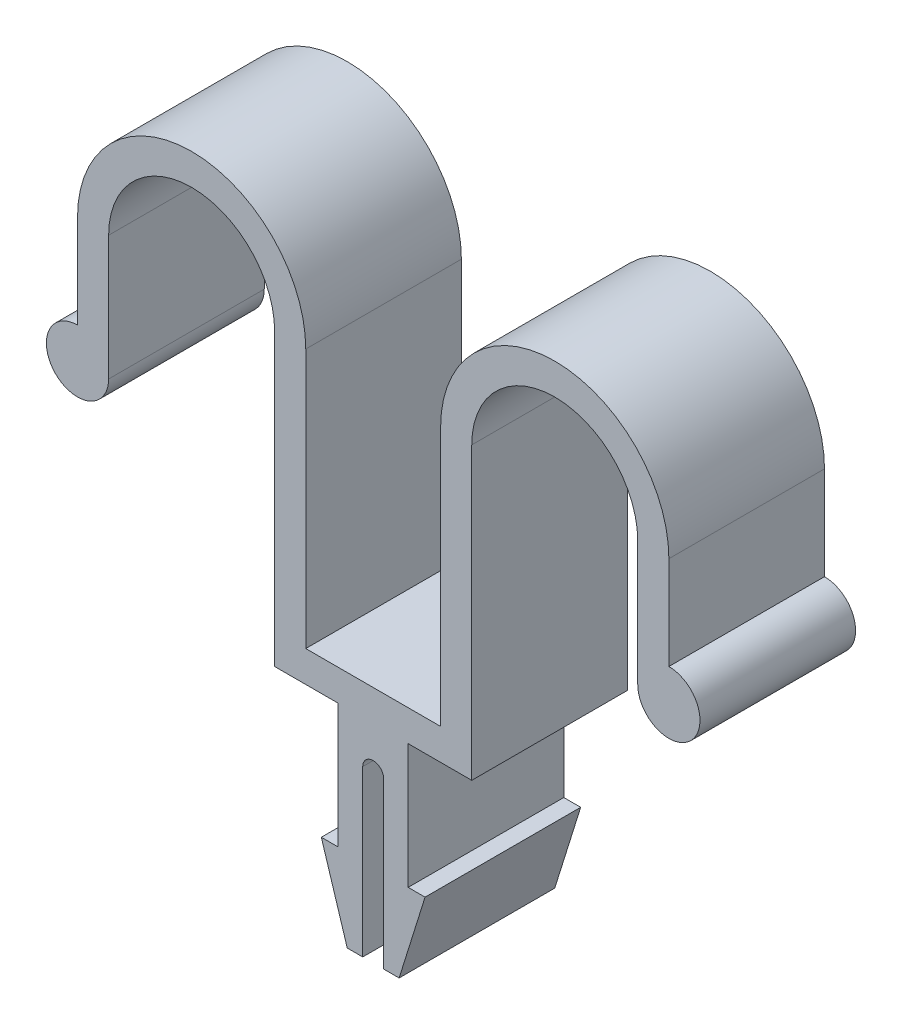
ISO-10303-21;
HEADER;
FILE_DESCRIPTION(('STEP AP214'),'2;1');
FILE_NAME('part.step','',(''),(''),'','','');
FILE_SCHEMA(('AUTOMOTIVE_DESIGN { 1 0 10303 214 1 1 1 1 }'));
ENDSEC;
DATA;
#1=APPLICATION_CONTEXT('core data for automotive mechanical design processes');
#2=APPLICATION_PROTOCOL_DEFINITION('international standard','automotive_design',2000,#1);
#3=PRODUCT_CONTEXT('',#1,'mechanical');
#4=PRODUCT('Part','Part','',(#3));
#5=PRODUCT_RELATED_PRODUCT_CATEGORY('part','',(#4));
#6=PRODUCT_DEFINITION_FORMATION('','',#4);
#7=PRODUCT_DEFINITION_CONTEXT('part definition',#1,'design');
#8=PRODUCT_DEFINITION('design','',#6,#7);
#9=PRODUCT_DEFINITION_SHAPE('','',#8);
#10=(LENGTH_UNIT() NAMED_UNIT(*) SI_UNIT(.MILLI.,.METRE.));
#11=(NAMED_UNIT(*) PLANE_ANGLE_UNIT() SI_UNIT($,.RADIAN.));
#12=(NAMED_UNIT(*) SI_UNIT($,.STERADIAN.) SOLID_ANGLE_UNIT());
#13=UNCERTAINTY_MEASURE_WITH_UNIT(LENGTH_MEASURE(1.E-05),#10,'distance_accuracy_value','');
#14=(GEOMETRIC_REPRESENTATION_CONTEXT(3) GLOBAL_UNCERTAINTY_ASSIGNED_CONTEXT((#13)) GLOBAL_UNIT_ASSIGNED_CONTEXT((#10,
#11,#12)) REPRESENTATION_CONTEXT('',''));
#15=CARTESIAN_POINT('',(0.,0.,0.));
#16=DIRECTION('',(0.,0.,1.));
#17=DIRECTION('',(1.,0.,0.));
#18=AXIS2_PLACEMENT_3D('',#15,#16,#17);
#19=CARTESIAN_POINT('',(0.,0.,15.));
#20=DIRECTION('',(0.,0.,-1.));
#21=DIRECTION('',(-1.,0.,0.));
#22=AXIS2_PLACEMENT_3D('',#19,#20,#21);
#23=CYLINDRICAL_SURFACE('',#22,3.);
#24=CARTESIAN_POINT('',(0.,0.,0.));
#25=DIRECTION('',(0.,0.,1.));
#26=DIRECTION('',(1.,0.,0.));
#27=AXIS2_PLACEMENT_3D('',#24,#25,#26);
#28=CIRCLE('',#27,3.);
#29=CARTESIAN_POINT('',(0.,3.,0.));
#30=VERTEX_POINT('',#29);
#31=CARTESIAN_POINT('',(3.,0.,0.));
#32=VERTEX_POINT('',#31);
#33=EDGE_CURVE('E266',#30,#32,#28,.T.);
#34=ORIENTED_EDGE('',*,*,#33,.T.);
#35=DIRECTION('',(0.,0.,-1.));
#36=VECTOR('',#35,1.);
#37=CARTESIAN_POINT('',(3.,0.,15.));
#38=LINE('',#37,#36);
#39=CARTESIAN_POINT('',(3.,0.,15.));
#40=VERTEX_POINT('',#39);
#41=EDGE_CURVE('E11',#40,#32,#38,.T.);
#42=ORIENTED_EDGE('',*,*,#41,.F.);
#43=CARTESIAN_POINT('',(0.,0.,15.));
#44=DIRECTION('',(0.,0.,1.));
#45=DIRECTION('',(1.,0.,0.));
#46=AXIS2_PLACEMENT_3D('',#43,#44,#45);
#47=CIRCLE('',#46,3.);
#48=CARTESIAN_POINT('',(0.,3.,15.));
#49=VERTEX_POINT('',#48);
#50=EDGE_CURVE('E351',#49,#40,#47,.T.);
#51=ORIENTED_EDGE('',*,*,#50,.F.);
#52=DIRECTION('',(0.,0.,-1.));
#53=VECTOR('',#52,1.);
#54=CARTESIAN_POINT('',(0.,3.,15.));
#55=LINE('',#54,#53);
#56=EDGE_CURVE('E262',#49,#30,#55,.T.);
#57=ORIENTED_EDGE('',*,*,#56,.T.);
#58=EDGE_LOOP('',(#34,#42,#51,#57));
#59=FACE_BOUND('',#58,.T.);
#60=ADVANCED_FACE('F39',(#59),#23,.T.);
#61=CARTESIAN_POINT('',(3.,0.,15.));
#62=DIRECTION('',(-1.,0.,0.));
#63=DIRECTION('',(0.,-1.,0.));
#64=AXIS2_PLACEMENT_3D('',#61,#62,#63);
#65=PLANE('',#64);
#66=DIRECTION('',(0.,1.,0.));
#67=VECTOR('',#66,1.);
#68=CARTESIAN_POINT('',(3.,0.,0.));
#69=LINE('',#68,#67);
#70=CARTESIAN_POINT('',(3.,12.,0.));
#71=VERTEX_POINT('',#70);
#72=EDGE_CURVE('E270',#32,#71,#69,.T.);
#73=ORIENTED_EDGE('',*,*,#72,.T.);
#74=DIRECTION('',(0.,0.,-1.));
#75=VECTOR('',#74,1.);
#76=CARTESIAN_POINT('',(3.,12.,15.));
#77=LINE('',#76,#75);
#78=CARTESIAN_POINT('',(3.,12.,15.));
#79=VERTEX_POINT('',#78);
#80=EDGE_CURVE('E48',#79,#71,#77,.T.);
#81=ORIENTED_EDGE('',*,*,#80,.F.);
#82=DIRECTION('',(0.,1.,0.));
#83=VECTOR('',#82,1.);
#84=CARTESIAN_POINT('',(3.,0.,15.));
#85=LINE('',#84,#83);
#86=EDGE_CURVE('E162',#40,#79,#85,.T.);
#87=ORIENTED_EDGE('',*,*,#86,.F.);
#88=ORIENTED_EDGE('',*,*,#41,.T.);
#89=EDGE_LOOP('',(#73,#81,#87,#88));
#90=FACE_BOUND('',#89,.T.);
#91=ADVANCED_FACE('F564',(#90),#65,.F.);
#92=CARTESIAN_POINT('',(11.,12.,15.));
#93=DIRECTION('',(0.,0.,-1.));
#94=DIRECTION('',(-1.,0.,0.));
#95=AXIS2_PLACEMENT_3D('',#92,#93,#94);
#96=CYLINDRICAL_SURFACE('',#95,8.);
#97=CARTESIAN_POINT('',(11.,12.,0.));
#98=DIRECTION('',(0.,0.,-1.));
#99=DIRECTION('',(-1.,0.,0.));
#100=AXIS2_PLACEMENT_3D('',#97,#98,#99);
#101=CIRCLE('',#100,8.);
#102=CARTESIAN_POINT('',(19.,12.,0.));
#103=VERTEX_POINT('',#102);
#104=EDGE_CURVE('E273',#71,#103,#101,.T.);
#105=ORIENTED_EDGE('',*,*,#104,.T.);
#106=DIRECTION('',(0.,0.,-1.));
#107=VECTOR('',#106,1.);
#108=CARTESIAN_POINT('',(19.,12.,15.));
#109=LINE('',#108,#107);
#110=CARTESIAN_POINT('',(19.,12.,15.));
#111=VERTEX_POINT('',#110);
#112=EDGE_CURVE('E446',#111,#103,#109,.T.);
#113=ORIENTED_EDGE('',*,*,#112,.F.);
#114=CARTESIAN_POINT('',(11.,12.,15.));
#115=DIRECTION('',(0.,0.,-1.));
#116=DIRECTION('',(-1.,0.,0.));
#117=AXIS2_PLACEMENT_3D('',#114,#115,#116);
#118=CIRCLE('',#117,8.);
#119=EDGE_CURVE('E456',#79,#111,#118,.T.);
#120=ORIENTED_EDGE('',*,*,#119,.F.);
#121=ORIENTED_EDGE('',*,*,#80,.T.);
#122=EDGE_LOOP('',(#105,#113,#120,#121));
#123=FACE_BOUND('',#122,.T.);
#124=ADVANCED_FACE('F454',(#123),#96,.F.);
#125=CARTESIAN_POINT('',(19.,12.,15.));
#126=DIRECTION('',(1.,0.,0.));
#127=DIRECTION('',(0.,1.,0.));
#128=AXIS2_PLACEMENT_3D('',#125,#126,#127);
#129=PLANE('',#128);
#130=DIRECTION('',(0.,-1.,0.));
#131=VECTOR('',#130,1.);
#132=CARTESIAN_POINT('',(19.,12.,0.));
#133=LINE('',#132,#131);
#134=CARTESIAN_POINT('',(19.,-15.9999999999999,0.));
#135=VERTEX_POINT('',#134);
#136=EDGE_CURVE('E276',#103,#135,#133,.T.);
#137=ORIENTED_EDGE('',*,*,#136,.T.);
#138=DIRECTION('',(0.,0.,-1.));
#139=VECTOR('',#138,1.);
#140=CARTESIAN_POINT('',(19.,-15.9999999999999,15.));
#141=LINE('',#140,#139);
#142=CARTESIAN_POINT('',(19.,-15.9999999999999,15.));
#143=VERTEX_POINT('',#142);
#144=EDGE_CURVE('E442',#143,#135,#141,.T.);
#145=ORIENTED_EDGE('',*,*,#144,.F.);
#146=DIRECTION('',(0.,-1.,0.));
#147=VECTOR('',#146,1.);
#148=CARTESIAN_POINT('',(19.,12.,15.));
#149=LINE('',#148,#147);
#150=EDGE_CURVE('E475',#111,#143,#149,.T.);
#151=ORIENTED_EDGE('',*,*,#150,.F.);
#152=ORIENTED_EDGE('',*,*,#112,.T.);
#153=EDGE_LOOP('',(#137,#145,#151,#152));
#154=FACE_BOUND('',#153,.T.);
#155=ADVANCED_FACE('F465',(#154),#129,.F.);
#156=CARTESIAN_POINT('',(19.,-15.9999999999999,15.));
#157=DIRECTION('',(0.,1.,0.));
#158=DIRECTION('',(0.,0.,1.));
#159=AXIS2_PLACEMENT_3D('',#156,#157,#158);
#160=PLANE('',#159);
#161=DIRECTION('',(1.,0.,0.));
#162=VECTOR('',#161,1.);
#163=CARTESIAN_POINT('',(19.,-15.9999999999999,0.));
#164=LINE('',#163,#162);
#165=CARTESIAN_POINT('',(25.1285985389637,-15.9999999999999,0.));
#166=VERTEX_POINT('',#165);
#167=EDGE_CURVE('E279',#135,#166,#164,.T.);
#168=ORIENTED_EDGE('',*,*,#167,.T.);
#169=DIRECTION('',(0.,0.,-1.));
#170=VECTOR('',#169,1.);
#171=CARTESIAN_POINT('',(25.1285985389637,-15.9999999999999,15.));
#172=LINE('',#171,#170);
#173=CARTESIAN_POINT('',(25.1285985389637,-15.9999999999999,15.));
#174=VERTEX_POINT('',#173);
#175=EDGE_CURVE('E438',#174,#166,#172,.T.);
#176=ORIENTED_EDGE('',*,*,#175,.F.);
#177=DIRECTION('',(1.,0.,0.));
#178=VECTOR('',#177,1.);
#179=CARTESIAN_POINT('',(19.,-15.9999999999999,15.));
#180=LINE('',#179,#178);
#181=EDGE_CURVE('E471',#143,#174,#180,.T.);
#182=ORIENTED_EDGE('',*,*,#181,.F.);
#183=ORIENTED_EDGE('',*,*,#144,.T.);
#184=EDGE_LOOP('',(#168,#176,#182,#183));
#185=FACE_BOUND('',#184,.T.);
#186=ADVANCED_FACE('F469',(#185),#160,.F.);
#187=CARTESIAN_POINT('',(25.1285985389637,-15.9999999999999,15.));
#188=DIRECTION('',(1.,0.,0.));
#189=DIRECTION('',(0.,0.,-1.));
#190=AXIS2_PLACEMENT_3D('',#187,#188,#189);
#191=PLANE('',#190);
#192=DIRECTION('',(0.,-1.,0.));
#193=VECTOR('',#192,1.);
#194=CARTESIAN_POINT('',(25.1285985389637,-15.9999999999999,0.));
#195=LINE('',#194,#193);
#196=CARTESIAN_POINT('',(25.1285985389637,-27.9999999999999,0.));
#197=VERTEX_POINT('',#196);
#198=EDGE_CURVE('E282',#166,#197,#195,.T.);
#199=ORIENTED_EDGE('',*,*,#198,.T.);
#200=DIRECTION('',(0.,0.,-1.));
#201=VECTOR('',#200,1.);
#202=CARTESIAN_POINT('',(25.1285985389637,-27.9999999999999,15.));
#203=LINE('',#202,#201);
#204=CARTESIAN_POINT('',(25.1285985389637,-27.9999999999999,15.));
#205=VERTEX_POINT('',#204);
#206=EDGE_CURVE('E434',#205,#197,#203,.T.);
#207=ORIENTED_EDGE('',*,*,#206,.F.);
#208=DIRECTION('',(0.,-1.,0.));
#209=VECTOR('',#208,1.);
#210=CARTESIAN_POINT('',(25.1285985389637,-15.9999999999999,15.));
#211=LINE('',#210,#209);
#212=EDGE_CURVE('E474',#174,#205,#211,.T.);
#213=ORIENTED_EDGE('',*,*,#212,.F.);
#214=ORIENTED_EDGE('',*,*,#175,.T.);
#215=EDGE_LOOP('',(#199,#207,#213,#214));
#216=FACE_BOUND('',#215,.T.);
#217=ADVANCED_FACE('F577',(#216),#191,.F.);
#218=CARTESIAN_POINT('',(25.1285985389637,-27.9999999999999,15.));
#219=DIRECTION('',(0.,-1.,0.));
#220=DIRECTION('',(1.,0.,0.));
#221=AXIS2_PLACEMENT_3D('',#218,#219,#220);
#222=PLANE('',#221);
#223=DIRECTION('',(-1.,0.,0.));
#224=VECTOR('',#223,1.);
#225=CARTESIAN_POINT('',(25.1285985389637,-27.9999999999999,0.));
#226=LINE('',#225,#224);
#227=CARTESIAN_POINT('',(23.5,-27.9999999999999,0.));
#228=VERTEX_POINT('',#227);
#229=EDGE_CURVE('E285',#197,#228,#226,.T.);
#230=ORIENTED_EDGE('',*,*,#229,.T.);
#231=DIRECTION('',(0.,0.,-1.));
#232=VECTOR('',#231,1.);
#233=CARTESIAN_POINT('',(23.5,-27.9999999999999,15.));
#234=LINE('',#233,#232);
#235=CARTESIAN_POINT('',(23.5,-27.9999999999999,15.));
#236=VERTEX_POINT('',#235);
#237=EDGE_CURVE('E430',#236,#228,#234,.T.);
#238=ORIENTED_EDGE('',*,*,#237,.F.);
#239=DIRECTION('',(-1.,0.,0.));
#240=VECTOR('',#239,1.);
#241=CARTESIAN_POINT('',(25.1285985389637,-27.9999999999999,15.));
#242=LINE('',#241,#240);
#243=EDGE_CURVE('E479',#205,#236,#242,.T.);
#244=ORIENTED_EDGE('',*,*,#243,.F.);
#245=ORIENTED_EDGE('',*,*,#206,.T.);
#246=EDGE_LOOP('',(#230,#238,#244,#245));
#247=FACE_BOUND('',#246,.T.);
#248=ADVANCED_FACE('F580',(#247),#222,.F.);
#249=CARTESIAN_POINT('',(23.5,-27.9999999999999,15.));
#250=DIRECTION('',(0.954479978035029,0.298274993135948,0.));
#251=DIRECTION('',(-0.298274993135948,0.954479978035029,0.));
#252=AXIS2_PLACEMENT_3D('',#249,#250,#251);
#253=PLANE('',#252);
#254=DIRECTION('',(0.298274993135948,-0.95447997803503,0.));
#255=VECTOR('',#254,1.);
#256=CARTESIAN_POINT('',(23.5,-27.9999999999999,0.));
#257=LINE('',#256,#255);
#258=CARTESIAN_POINT('',(26.,-35.9999999999999,0.));
#259=VERTEX_POINT('',#258);
#260=EDGE_CURVE('E288',#228,#259,#257,.T.);
#261=ORIENTED_EDGE('',*,*,#260,.T.);
#262=DIRECTION('',(0.,0.,-1.));
#263=VECTOR('',#262,1.);
#264=CARTESIAN_POINT('',(26.,-35.9999999999999,15.));
#265=LINE('',#264,#263);
#266=CARTESIAN_POINT('',(26.,-35.9999999999999,15.));
#267=VERTEX_POINT('',#266);
#268=EDGE_CURVE('E426',#267,#259,#265,.T.);
#269=ORIENTED_EDGE('',*,*,#268,.F.);
#270=DIRECTION('',(0.298274993135948,-0.95447997803503,0.));
#271=VECTOR('',#270,1.);
#272=CARTESIAN_POINT('',(23.5,-27.9999999999999,15.));
#273=LINE('',#272,#271);
#274=EDGE_CURVE('E486',#236,#267,#273,.T.);
#275=ORIENTED_EDGE('',*,*,#274,.F.);
#276=ORIENTED_EDGE('',*,*,#237,.T.);
#277=EDGE_LOOP('',(#261,#269,#275,#276));
#278=FACE_BOUND('',#277,.T.);
#279=ADVANCED_FACE('F584',(#278),#253,.F.);
#280=CARTESIAN_POINT('',(26.,-35.9999999999999,15.));
#281=DIRECTION('',(0.,1.,0.));
#282=DIRECTION('',(0.,0.,1.));
#283=AXIS2_PLACEMENT_3D('',#280,#281,#282);
#284=PLANE('',#283);
#285=DIRECTION('',(1.,0.,0.));
#286=VECTOR('',#285,1.);
#287=CARTESIAN_POINT('',(26.,-35.9999999999999,0.));
#288=LINE('',#287,#286);
#289=CARTESIAN_POINT('',(27.492025934497,-35.9999999999999,0.));
#290=VERTEX_POINT('',#289);
#291=EDGE_CURVE('E291',#259,#290,#288,.T.);
#292=ORIENTED_EDGE('',*,*,#291,.T.);
#293=DIRECTION('',(0.,0.,-1.));
#294=VECTOR('',#293,1.);
#295=CARTESIAN_POINT('',(27.492025934497,-35.9999999999999,15.));
#296=LINE('',#295,#294);
#297=CARTESIAN_POINT('',(27.492025934497,-35.9999999999999,15.));
#298=VERTEX_POINT('',#297);
#299=EDGE_CURVE('E422',#298,#290,#296,.T.);
#300=ORIENTED_EDGE('',*,*,#299,.F.);
#301=DIRECTION('',(1.,0.,0.));
#302=VECTOR('',#301,1.);
#303=CARTESIAN_POINT('',(26.,-35.9999999999999,15.));
#304=LINE('',#303,#302);
#305=EDGE_CURVE('E489',#267,#298,#304,.T.);
#306=ORIENTED_EDGE('',*,*,#305,.F.);
#307=ORIENTED_EDGE('',*,*,#268,.T.);
#308=EDGE_LOOP('',(#292,#300,#306,#307));
#309=FACE_BOUND('',#308,.T.);
#310=ADVANCED_FACE('F588',(#309),#284,.F.);
#311=CARTESIAN_POINT('',(27.492025934497,-35.9999999999999,15.));
#312=DIRECTION('',(-1.,0.,0.));
#313=DIRECTION('',(0.,-1.,0.));
#314=AXIS2_PLACEMENT_3D('',#311,#312,#313);
#315=PLANE('',#314);
#316=DIRECTION('',(0.,1.,0.));
#317=VECTOR('',#316,1.);
#318=CARTESIAN_POINT('',(27.492025934497,-35.9999999999999,0.));
#319=LINE('',#318,#317);
#320=CARTESIAN_POINT('',(27.492025934497,-20.1055409966307,0.));
#321=VERTEX_POINT('',#320);
#322=EDGE_CURVE('E294',#290,#321,#319,.T.);
#323=ORIENTED_EDGE('',*,*,#322,.T.);
#324=DIRECTION('',(0.,0.,-1.));
#325=VECTOR('',#324,1.);
#326=CARTESIAN_POINT('',(27.492025934497,-20.1055409966307,15.));
#327=LINE('',#326,#325);
#328=CARTESIAN_POINT('',(27.492025934497,-20.1055409966307,15.));
#329=VERTEX_POINT('',#328);
#330=EDGE_CURVE('E418',#329,#321,#327,.T.);
#331=ORIENTED_EDGE('',*,*,#330,.F.);
#332=DIRECTION('',(0.,1.,0.));
#333=VECTOR('',#332,1.);
#334=CARTESIAN_POINT('',(27.492025934497,-35.9999999999999,15.));
#335=LINE('',#334,#333);
#336=EDGE_CURVE('E492',#298,#329,#335,.T.);
#337=ORIENTED_EDGE('',*,*,#336,.F.);
#338=ORIENTED_EDGE('',*,*,#299,.T.);
#339=EDGE_LOOP('',(#323,#331,#337,#338));
#340=FACE_BOUND('',#339,.T.);
#341=ADVANCED_FACE('F592',(#340),#315,.F.);
#342=CARTESIAN_POINT('',(28.492025934497,-20.1055409966307,15.));
#343=DIRECTION('',(0.,0.,-1.));
#344=DIRECTION('',(-1.,0.,0.));
#345=AXIS2_PLACEMENT_3D('',#342,#343,#344);
#346=CYLINDRICAL_SURFACE('',#345,0.999999999999997);
#347=CARTESIAN_POINT('',(28.492025934497,-20.1055409966307,0.));
#348=DIRECTION('',(0.,0.,-1.));
#349=DIRECTION('',(-1.,0.,0.));
#350=AXIS2_PLACEMENT_3D('',#347,#348,#349);
#351=CIRCLE('',#350,0.999999999999997);
#352=CARTESIAN_POINT('',(28.5,-19.1055727899964,0.));
#353=VERTEX_POINT('',#352);
#354=EDGE_CURVE('E297',#321,#353,#351,.T.);
#355=ORIENTED_EDGE('',*,*,#354,.T.);
#356=DIRECTION('',(0.,0.,-1.));
#357=VECTOR('',#356,1.);
#358=CARTESIAN_POINT('',(28.5,-19.1055727899964,15.));
#359=LINE('',#358,#357);
#360=CARTESIAN_POINT('',(28.5,-19.1055727899964,15.));
#361=VERTEX_POINT('',#360);
#362=EDGE_CURVE('E414',#361,#353,#359,.T.);
#363=ORIENTED_EDGE('',*,*,#362,.F.);
#364=CARTESIAN_POINT('',(28.492025934497,-20.1055409966307,15.));
#365=DIRECTION('',(0.,0.,-1.));
#366=DIRECTION('',(-1.,0.,0.));
#367=AXIS2_PLACEMENT_3D('',#364,#365,#366);
#368=CIRCLE('',#367,0.999999999999997);
#369=EDGE_CURVE('E495',#329,#361,#368,.T.);
#370=ORIENTED_EDGE('',*,*,#369,.F.);
#371=ORIENTED_EDGE('',*,*,#330,.T.);
#372=EDGE_LOOP('',(#355,#363,#370,#371));
#373=FACE_BOUND('',#372,.T.);
#374=ADVANCED_FACE('F596',(#373),#346,.F.);
#375=CARTESIAN_POINT('',(28.507974065503,-20.1055409966307,15.));
#376=DIRECTION('',(0.,0.,-1.));
#377=DIRECTION('',(-1.,0.,0.));
#378=AXIS2_PLACEMENT_3D('',#375,#376,#377);
#379=CYLINDRICAL_SURFACE('',#378,0.999999999999997);
#380=CARTESIAN_POINT('',(28.507974065503,-20.1055409966307,0.));
#381=DIRECTION('',(0.,0.,-1.));
#382=DIRECTION('',(1.,0.,0.));
#383=AXIS2_PLACEMENT_3D('',#380,#381,#382);
#384=CIRCLE('',#383,0.999999999999997);
#385=CARTESIAN_POINT('',(29.507974065503,-20.1055409966307,0.));
#386=VERTEX_POINT('',#385);
#387=EDGE_CURVE('E300',#353,#386,#384,.T.);
#388=ORIENTED_EDGE('',*,*,#387,.T.);
#389=DIRECTION('',(0.,0.,-1.));
#390=VECTOR('',#389,1.);
#391=CARTESIAN_POINT('',(29.507974065503,-20.1055409966307,15.));
#392=LINE('',#391,#390);
#393=CARTESIAN_POINT('',(29.507974065503,-20.1055409966307,15.));
#394=VERTEX_POINT('',#393);
#395=EDGE_CURVE('E410',#394,#386,#392,.T.);
#396=ORIENTED_EDGE('',*,*,#395,.F.);
#397=CARTESIAN_POINT('',(28.507974065503,-20.1055409966307,15.));
#398=DIRECTION('',(0.,0.,-1.));
#399=DIRECTION('',(1.,0.,0.));
#400=AXIS2_PLACEMENT_3D('',#397,#398,#399);
#401=CIRCLE('',#400,0.999999999999997);
#402=EDGE_CURVE('E498',#361,#394,#401,.T.);
#403=ORIENTED_EDGE('',*,*,#402,.F.);
#404=ORIENTED_EDGE('',*,*,#362,.T.);
#405=EDGE_LOOP('',(#388,#396,#403,#404));
#406=FACE_BOUND('',#405,.T.);
#407=ADVANCED_FACE('F600',(#406),#379,.F.);
#408=CARTESIAN_POINT('',(29.507974065503,-35.9999999999999,15.));
#409=DIRECTION('',(1.,0.,0.));
#410=DIRECTION('',(0.,1.,0.));
#411=AXIS2_PLACEMENT_3D('',#408,#409,#410);
#412=PLANE('',#411);
#413=DIRECTION('',(0.,-1.,0.));
#414=VECTOR('',#413,1.);
#415=CARTESIAN_POINT('',(29.507974065503,-35.9999999999999,0.));
#416=LINE('',#415,#414);
#417=CARTESIAN_POINT('',(29.507974065503,-35.9999999999999,0.));
#418=VERTEX_POINT('',#417);
#419=EDGE_CURVE('E303',#386,#418,#416,.T.);
#420=ORIENTED_EDGE('',*,*,#419,.T.);
#421=DIRECTION('',(0.,0.,-1.));
#422=VECTOR('',#421,1.);
#423=CARTESIAN_POINT('',(29.507974065503,-35.9999999999999,15.));
#424=LINE('',#423,#422);
#425=CARTESIAN_POINT('',(29.507974065503,-35.9999999999999,15.));
#426=VERTEX_POINT('',#425);
#427=EDGE_CURVE('E406',#426,#418,#424,.T.);
#428=ORIENTED_EDGE('',*,*,#427,.F.);
#429=DIRECTION('',(0.,-1.,0.));
#430=VECTOR('',#429,1.);
#431=CARTESIAN_POINT('',(29.507974065503,-35.9999999999999,15.));
#432=LINE('',#431,#430);
#433=EDGE_CURVE('E501',#394,#426,#432,.T.);
#434=ORIENTED_EDGE('',*,*,#433,.F.);
#435=ORIENTED_EDGE('',*,*,#395,.T.);
#436=EDGE_LOOP('',(#420,#428,#434,#435));
#437=FACE_BOUND('',#436,.T.);
#438=ADVANCED_FACE('F604',(#437),#412,.F.);
#439=CARTESIAN_POINT('',(31.,-35.9999999999999,15.));
#440=DIRECTION('',(0.,1.,0.));
#441=DIRECTION('',(0.,0.,1.));
#442=AXIS2_PLACEMENT_3D('',#439,#440,#441);
#443=PLANE('',#442);
#444=DIRECTION('',(1.,0.,0.));
#445=VECTOR('',#444,1.);
#446=CARTESIAN_POINT('',(31.,-35.9999999999999,0.));
#447=LINE('',#446,#445);
#448=CARTESIAN_POINT('',(31.,-35.9999999999999,0.));
#449=VERTEX_POINT('',#448);
#450=EDGE_CURVE('E306',#418,#449,#447,.T.);
#451=ORIENTED_EDGE('',*,*,#450,.T.);
#452=DIRECTION('',(0.,0.,-1.));
#453=VECTOR('',#452,1.);
#454=CARTESIAN_POINT('',(31.,-35.9999999999999,15.));
#455=LINE('',#454,#453);
#456=CARTESIAN_POINT('',(31.,-35.9999999999999,15.));
#457=VERTEX_POINT('',#456);
#458=EDGE_CURVE('E402',#457,#449,#455,.T.);
#459=ORIENTED_EDGE('',*,*,#458,.F.);
#460=DIRECTION('',(1.,0.,0.));
#461=VECTOR('',#460,1.);
#462=CARTESIAN_POINT('',(31.,-35.9999999999999,15.));
#463=LINE('',#462,#461);
#464=EDGE_CURVE('E504',#426,#457,#463,.T.);
#465=ORIENTED_EDGE('',*,*,#464,.F.);
#466=ORIENTED_EDGE('',*,*,#427,.T.);
#467=EDGE_LOOP('',(#451,#459,#465,#466));
#468=FACE_BOUND('',#467,.T.);
#469=ADVANCED_FACE('F608',(#468),#443,.F.);
#470=CARTESIAN_POINT('',(33.5,-27.9999999999999,15.));
#471=DIRECTION('',(-0.954479978035029,0.298274993135948,0.));
#472=DIRECTION('',(-0.298274993135948,-0.954479978035029,0.));
#473=AXIS2_PLACEMENT_3D('',#470,#471,#472);
#474=PLANE('',#473);
#475=DIRECTION('',(0.298274993135948,0.954479978035029,0.));
#476=VECTOR('',#475,1.);
#477=CARTESIAN_POINT('',(33.5,-27.9999999999999,0.));
#478=LINE('',#477,#476);
#479=CARTESIAN_POINT('',(33.5,-27.9999999999999,0.));
#480=VERTEX_POINT('',#479);
#481=EDGE_CURVE('E309',#449,#480,#478,.T.);
#482=ORIENTED_EDGE('',*,*,#481,.T.);
#483=DIRECTION('',(0.,0.,-1.));
#484=VECTOR('',#483,1.);
#485=CARTESIAN_POINT('',(33.5,-27.9999999999999,15.));
#486=LINE('',#485,#484);
#487=CARTESIAN_POINT('',(33.5,-27.9999999999999,15.));
#488=VERTEX_POINT('',#487);
#489=EDGE_CURVE('E398',#488,#480,#486,.T.);
#490=ORIENTED_EDGE('',*,*,#489,.F.);
#491=DIRECTION('',(0.298274993135948,0.954479978035029,0.));
#492=VECTOR('',#491,1.);
#493=CARTESIAN_POINT('',(33.5,-27.9999999999999,15.));
#494=LINE('',#493,#492);
#495=EDGE_CURVE('E507',#457,#488,#494,.T.);
#496=ORIENTED_EDGE('',*,*,#495,.F.);
#497=ORIENTED_EDGE('',*,*,#458,.T.);
#498=EDGE_LOOP('',(#482,#490,#496,#497));
#499=FACE_BOUND('',#498,.T.);
#500=ADVANCED_FACE('F612',(#499),#474,.F.);
#501=CARTESIAN_POINT('',(31.8714014610363,-27.9999999999999,15.));
#502=DIRECTION('',(0.,-1.,0.));
#503=DIRECTION('',(1.,0.,0.));
#504=AXIS2_PLACEMENT_3D('',#501,#502,#503);
#505=PLANE('',#504);
#506=DIRECTION('',(-1.,0.,0.));
#507=VECTOR('',#506,1.);
#508=CARTESIAN_POINT('',(31.8714014610363,-27.9999999999999,0.));
#509=LINE('',#508,#507);
#510=CARTESIAN_POINT('',(31.8714014610363,-27.9999999999999,0.));
#511=VERTEX_POINT('',#510);
#512=EDGE_CURVE('E312',#480,#511,#509,.T.);
#513=ORIENTED_EDGE('',*,*,#512,.T.);
#514=DIRECTION('',(0.,0.,-1.));
#515=VECTOR('',#514,1.);
#516=CARTESIAN_POINT('',(31.8714014610363,-27.9999999999999,15.));
#517=LINE('',#516,#515);
#518=CARTESIAN_POINT('',(31.8714014610363,-27.9999999999999,15.));
#519=VERTEX_POINT('',#518);
#520=EDGE_CURVE('E394',#519,#511,#517,.T.);
#521=ORIENTED_EDGE('',*,*,#520,.F.);
#522=DIRECTION('',(-1.,0.,0.));
#523=VECTOR('',#522,1.);
#524=CARTESIAN_POINT('',(31.8714014610363,-27.9999999999999,15.));
#525=LINE('',#524,#523);
#526=EDGE_CURVE('E510',#488,#519,#525,.T.);
#527=ORIENTED_EDGE('',*,*,#526,.F.);
#528=ORIENTED_EDGE('',*,*,#489,.T.);
#529=EDGE_LOOP('',(#513,#521,#527,#528));
#530=FACE_BOUND('',#529,.T.);
#531=ADVANCED_FACE('F616',(#530),#505,.F.);
#532=CARTESIAN_POINT('',(31.8714014610363,-15.9999999999999,15.));
#533=DIRECTION('',(-1.,0.,0.));
#534=DIRECTION('',(0.,0.,1.));
#535=AXIS2_PLACEMENT_3D('',#532,#533,#534);
#536=PLANE('',#535);
#537=DIRECTION('',(0.,1.,0.));
#538=VECTOR('',#537,1.);
#539=CARTESIAN_POINT('',(31.8714014610363,-15.9999999999999,0.));
#540=LINE('',#539,#538);
#541=CARTESIAN_POINT('',(31.8714014610363,-15.9999999999999,0.));
#542=VERTEX_POINT('',#541);
#543=EDGE_CURVE('E315',#511,#542,#540,.T.);
#544=ORIENTED_EDGE('',*,*,#543,.T.);
#545=DIRECTION('',(0.,0.,-1.));
#546=VECTOR('',#545,1.);
#547=CARTESIAN_POINT('',(31.8714014610363,-15.9999999999999,15.));
#548=LINE('',#547,#546);
#549=CARTESIAN_POINT('',(31.8714014610363,-15.9999999999999,15.));
#550=VERTEX_POINT('',#549);
#551=EDGE_CURVE('E390',#550,#542,#548,.T.);
#552=ORIENTED_EDGE('',*,*,#551,.F.);
#553=DIRECTION('',(0.,1.,0.));
#554=VECTOR('',#553,1.);
#555=CARTESIAN_POINT('',(31.8714014610363,-15.9999999999999,15.));
#556=LINE('',#555,#554);
#557=EDGE_CURVE('E513',#519,#550,#556,.T.);
#558=ORIENTED_EDGE('',*,*,#557,.F.);
#559=ORIENTED_EDGE('',*,*,#520,.T.);
#560=EDGE_LOOP('',(#544,#552,#558,#559));
#561=FACE_BOUND('',#560,.T.);
#562=ADVANCED_FACE('F620',(#561),#536,.F.);
#563=CARTESIAN_POINT('',(38.,-15.9999999999999,15.));
#564=DIRECTION('',(0.,1.,0.));
#565=DIRECTION('',(0.,0.,1.));
#566=AXIS2_PLACEMENT_3D('',#563,#564,#565);
#567=PLANE('',#566);
#568=DIRECTION('',(1.,0.,0.));
#569=VECTOR('',#568,1.);
#570=CARTESIAN_POINT('',(38.,-15.9999999999999,0.));
#571=LINE('',#570,#569);
#572=CARTESIAN_POINT('',(38.,-15.9999999999999,0.));
#573=VERTEX_POINT('',#572);
#574=EDGE_CURVE('E318',#542,#573,#571,.T.);
#575=ORIENTED_EDGE('',*,*,#574,.T.);
#576=DIRECTION('',(0.,0.,-1.));
#577=VECTOR('',#576,1.);
#578=CARTESIAN_POINT('',(38.,-15.9999999999999,15.));
#579=LINE('',#578,#577);
#580=CARTESIAN_POINT('',(38.,-15.9999999999999,15.));
#581=VERTEX_POINT('',#580);
#582=EDGE_CURVE('E386',#581,#573,#579,.T.);
#583=ORIENTED_EDGE('',*,*,#582,.F.);
#584=DIRECTION('',(1.,0.,0.));
#585=VECTOR('',#584,1.);
#586=CARTESIAN_POINT('',(38.,-15.9999999999999,15.));
#587=LINE('',#586,#585);
#588=EDGE_CURVE('E516',#550,#581,#587,.T.);
#589=ORIENTED_EDGE('',*,*,#588,.F.);
#590=ORIENTED_EDGE('',*,*,#551,.T.);
#591=EDGE_LOOP('',(#575,#583,#589,#590));
#592=FACE_BOUND('',#591,.T.);
#593=ADVANCED_FACE('F624',(#592),#567,.F.);
#594=CARTESIAN_POINT('',(38.,12.,15.));
#595=DIRECTION('',(-1.,0.,0.));
#596=DIRECTION('',(0.,0.,1.));
#597=AXIS2_PLACEMENT_3D('',#594,#595,#596);
#598=PLANE('',#597);
#599=DIRECTION('',(0.,1.,0.));
#600=VECTOR('',#599,1.);
#601=CARTESIAN_POINT('',(38.,12.,0.));
#602=LINE('',#601,#600);
#603=CARTESIAN_POINT('',(38.,12.,0.));
#604=VERTEX_POINT('',#603);
#605=EDGE_CURVE('E321',#573,#604,#602,.T.);
#606=ORIENTED_EDGE('',*,*,#605,.T.);
#607=DIRECTION('',(0.,0.,-1.));
#608=VECTOR('',#607,1.);
#609=CARTESIAN_POINT('',(38.,12.,15.));
#610=LINE('',#609,#608);
#611=CARTESIAN_POINT('',(38.,12.,15.));
#612=VERTEX_POINT('',#611);
#613=EDGE_CURVE('E382',#612,#604,#610,.T.);
#614=ORIENTED_EDGE('',*,*,#613,.F.);
#615=DIRECTION('',(0.,1.,0.));
#616=VECTOR('',#615,1.);
#617=CARTESIAN_POINT('',(38.,12.,15.));
#618=LINE('',#617,#616);
#619=EDGE_CURVE('E519',#581,#612,#618,.T.);
#620=ORIENTED_EDGE('',*,*,#619,.F.);
#621=ORIENTED_EDGE('',*,*,#582,.T.);
#622=EDGE_LOOP('',(#606,#614,#620,#621));
#623=FACE_BOUND('',#622,.T.);
#624=ADVANCED_FACE('F628',(#623),#598,.F.);
#625=CARTESIAN_POINT('',(46.,12.,15.));
#626=DIRECTION('',(0.,0.,-1.));
#627=DIRECTION('',(-1.,0.,0.));
#628=AXIS2_PLACEMENT_3D('',#625,#626,#627);
#629=CYLINDRICAL_SURFACE('',#628,8.);
#630=CARTESIAN_POINT('',(46.,12.,0.));
#631=DIRECTION('',(0.,0.,-1.));
#632=DIRECTION('',(1.,0.,0.));
#633=AXIS2_PLACEMENT_3D('',#630,#631,#632);
#634=CIRCLE('',#633,8.);
#635=CARTESIAN_POINT('',(54.,12.,0.));
#636=VERTEX_POINT('',#635);
#637=EDGE_CURVE('E324',#604,#636,#634,.T.);
#638=ORIENTED_EDGE('',*,*,#637,.T.);
#639=DIRECTION('',(0.,0.,-1.));
#640=VECTOR('',#639,1.);
#641=CARTESIAN_POINT('',(54.,12.,15.));
#642=LINE('',#641,#640);
#643=CARTESIAN_POINT('',(54.,12.,15.));
#644=VERTEX_POINT('',#643);
#645=EDGE_CURVE('E378',#644,#636,#642,.T.);
#646=ORIENTED_EDGE('',*,*,#645,.F.);
#647=CARTESIAN_POINT('',(46.,12.,15.));
#648=DIRECTION('',(0.,0.,-1.));
#649=DIRECTION('',(1.,0.,0.));
#650=AXIS2_PLACEMENT_3D('',#647,#648,#649);
#651=CIRCLE('',#650,8.);
#652=EDGE_CURVE('E522',#612,#644,#651,.T.);
#653=ORIENTED_EDGE('',*,*,#652,.F.);
#654=ORIENTED_EDGE('',*,*,#613,.T.);
#655=EDGE_LOOP('',(#638,#646,#653,#654));
#656=FACE_BOUND('',#655,.T.);
#657=ADVANCED_FACE('F632',(#656),#629,.F.);
#658=CARTESIAN_POINT('',(54.,0.,15.));
#659=DIRECTION('',(1.,0.,0.));
#660=DIRECTION('',(0.,1.,0.));
#661=AXIS2_PLACEMENT_3D('',#658,#659,#660);
#662=PLANE('',#661);
#663=DIRECTION('',(0.,-1.,0.));
#664=VECTOR('',#663,1.);
#665=CARTESIAN_POINT('',(54.,0.,0.));
#666=LINE('',#665,#664);
#667=CARTESIAN_POINT('',(54.,0.,0.));
#668=VERTEX_POINT('',#667);
#669=EDGE_CURVE('E327',#636,#668,#666,.T.);
#670=ORIENTED_EDGE('',*,*,#669,.T.);
#671=DIRECTION('',(0.,0.,-1.));
#672=VECTOR('',#671,1.);
#673=CARTESIAN_POINT('',(54.,0.,15.));
#674=LINE('',#673,#672);
#675=CARTESIAN_POINT('',(54.,0.,15.));
#676=VERTEX_POINT('',#675);
#677=EDGE_CURVE('E374',#676,#668,#674,.T.);
#678=ORIENTED_EDGE('',*,*,#677,.F.);
#679=DIRECTION('',(0.,-1.,0.));
#680=VECTOR('',#679,1.);
#681=CARTESIAN_POINT('',(54.,0.,15.));
#682=LINE('',#681,#680);
#683=EDGE_CURVE('E525',#644,#676,#682,.T.);
#684=ORIENTED_EDGE('',*,*,#683,.F.);
#685=ORIENTED_EDGE('',*,*,#645,.T.);
#686=EDGE_LOOP('',(#670,#678,#684,#685));
#687=FACE_BOUND('',#686,.T.);
#688=ADVANCED_FACE('F636',(#687),#662,.F.);
#689=CARTESIAN_POINT('',(57.,0.,15.));
#690=DIRECTION('',(0.,0.,-1.));
#691=DIRECTION('',(-1.,0.,0.));
#692=AXIS2_PLACEMENT_3D('',#689,#690,#691);
#693=CYLINDRICAL_SURFACE('',#692,3.);
#694=CARTESIAN_POINT('',(57.,0.,0.));
#695=DIRECTION('',(0.,0.,1.));
#696=DIRECTION('',(-1.,0.,0.));
#697=AXIS2_PLACEMENT_3D('',#694,#695,#696);
#698=CIRCLE('',#697,3.);
#699=CARTESIAN_POINT('',(57.,3.,0.));
#700=VERTEX_POINT('',#699);
#701=EDGE_CURVE('E330',#668,#700,#698,.T.);
#702=ORIENTED_EDGE('',*,*,#701,.T.);
#703=DIRECTION('',(0.,0.,-1.));
#704=VECTOR('',#703,1.);
#705=CARTESIAN_POINT('',(57.,3.,15.));
#706=LINE('',#705,#704);
#707=CARTESIAN_POINT('',(57.,3.,15.));
#708=VERTEX_POINT('',#707);
#709=EDGE_CURVE('E370',#708,#700,#706,.T.);
#710=ORIENTED_EDGE('',*,*,#709,.F.);
#711=CARTESIAN_POINT('',(57.,0.,15.));
#712=DIRECTION('',(0.,0.,1.));
#713=DIRECTION('',(-1.,0.,0.));
#714=AXIS2_PLACEMENT_3D('',#711,#712,#713);
#715=CIRCLE('',#714,3.);
#716=EDGE_CURVE('E528',#676,#708,#715,.T.);
#717=ORIENTED_EDGE('',*,*,#716,.F.);
#718=ORIENTED_EDGE('',*,*,#677,.T.);
#719=EDGE_LOOP('',(#702,#710,#717,#718));
#720=FACE_BOUND('',#719,.T.);
#721=ADVANCED_FACE('F640',(#720),#693,.T.);
#722=CARTESIAN_POINT('',(57.,3.,15.));
#723=DIRECTION('',(-1.,0.,0.));
#724=DIRECTION('',(0.,0.,1.));
#725=AXIS2_PLACEMENT_3D('',#722,#723,#724);
#726=PLANE('',#725);
#727=DIRECTION('',(0.,1.,0.));
#728=VECTOR('',#727,1.);
#729=CARTESIAN_POINT('',(57.,3.,0.));
#730=LINE('',#729,#728);
#731=CARTESIAN_POINT('',(57.,12.,0.));
#732=VERTEX_POINT('',#731);
#733=EDGE_CURVE('E333',#700,#732,#730,.T.);
#734=ORIENTED_EDGE('',*,*,#733,.T.);
#735=DIRECTION('',(0.,0.,-1.));
#736=VECTOR('',#735,1.);
#737=CARTESIAN_POINT('',(57.,12.,15.));
#738=LINE('',#737,#736);
#739=CARTESIAN_POINT('',(57.,12.,15.));
#740=VERTEX_POINT('',#739);
#741=EDGE_CURVE('E366',#740,#732,#738,.T.);
#742=ORIENTED_EDGE('',*,*,#741,.F.);
#743=DIRECTION('',(0.,1.,0.));
#744=VECTOR('',#743,1.);
#745=CARTESIAN_POINT('',(57.,3.,15.));
#746=LINE('',#745,#744);
#747=EDGE_CURVE('E531',#708,#740,#746,.T.);
#748=ORIENTED_EDGE('',*,*,#747,.F.);
#749=ORIENTED_EDGE('',*,*,#709,.T.);
#750=EDGE_LOOP('',(#734,#742,#748,#749));
#751=FACE_BOUND('',#750,.T.);
#752=ADVANCED_FACE('F644',(#751),#726,.F.);
#753=CARTESIAN_POINT('',(46.,12.,15.));
#754=DIRECTION('',(0.,0.,-1.));
#755=DIRECTION('',(-1.,0.,0.));
#756=AXIS2_PLACEMENT_3D('',#753,#754,#755);
#757=CYLINDRICAL_SURFACE('',#756,11.);
#758=CARTESIAN_POINT('',(46.,12.,0.));
#759=DIRECTION('',(0.,0.,1.));
#760=DIRECTION('',(1.,0.,0.));
#761=AXIS2_PLACEMENT_3D('',#758,#759,#760);
#762=CIRCLE('',#761,11.);
#763=CARTESIAN_POINT('',(35.,12.,0.));
#764=VERTEX_POINT('',#763);
#765=EDGE_CURVE('E336',#732,#764,#762,.T.);
#766=ORIENTED_EDGE('',*,*,#765,.T.);
#767=DIRECTION('',(0.,0.,-1.));
#768=VECTOR('',#767,1.);
#769=CARTESIAN_POINT('',(35.,12.,15.));
#770=LINE('',#769,#768);
#771=CARTESIAN_POINT('',(35.,12.,15.));
#772=VERTEX_POINT('',#771);
#773=EDGE_CURVE('E362',#772,#764,#770,.T.);
#774=ORIENTED_EDGE('',*,*,#773,.F.);
#775=CARTESIAN_POINT('',(46.,12.,15.));
#776=DIRECTION('',(0.,0.,1.));
#777=DIRECTION('',(1.,0.,0.));
#778=AXIS2_PLACEMENT_3D('',#775,#776,#777);
#779=CIRCLE('',#778,11.);
#780=EDGE_CURVE('E534',#740,#772,#779,.T.);
#781=ORIENTED_EDGE('',*,*,#780,.F.);
#782=ORIENTED_EDGE('',*,*,#741,.T.);
#783=EDGE_LOOP('',(#766,#774,#781,#782));
#784=FACE_BOUND('',#783,.T.);
#785=ADVANCED_FACE('F648',(#784),#757,.T.);
#786=CARTESIAN_POINT('',(35.,12.,15.));
#787=DIRECTION('',(1.,0.,0.));
#788=DIRECTION('',(0.,1.,0.));
#789=AXIS2_PLACEMENT_3D('',#786,#787,#788);
#790=PLANE('',#789);
#791=DIRECTION('',(0.,-1.,0.));
#792=VECTOR('',#791,1.);
#793=CARTESIAN_POINT('',(35.,12.,0.));
#794=LINE('',#793,#792);
#795=CARTESIAN_POINT('',(35.,-12.9999999999999,0.));
#796=VERTEX_POINT('',#795);
#797=EDGE_CURVE('E339',#764,#796,#794,.T.);
#798=ORIENTED_EDGE('',*,*,#797,.T.);
#799=DIRECTION('',(0.,0.,-1.));
#800=VECTOR('',#799,1.);
#801=CARTESIAN_POINT('',(35.,-12.9999999999999,15.));
#802=LINE('',#801,#800);
#803=CARTESIAN_POINT('',(35.,-12.9999999999999,15.));
#804=VERTEX_POINT('',#803);
#805=EDGE_CURVE('E358',#804,#796,#802,.T.);
#806=ORIENTED_EDGE('',*,*,#805,.F.);
#807=DIRECTION('',(0.,-1.,0.));
#808=VECTOR('',#807,1.);
#809=CARTESIAN_POINT('',(35.,12.,15.));
#810=LINE('',#809,#808);
#811=EDGE_CURVE('E537',#772,#804,#810,.T.);
#812=ORIENTED_EDGE('',*,*,#811,.F.);
#813=ORIENTED_EDGE('',*,*,#773,.T.);
#814=EDGE_LOOP('',(#798,#806,#812,#813));
#815=FACE_BOUND('',#814,.T.);
#816=ADVANCED_FACE('F545',(#815),#790,.F.);
#817=CARTESIAN_POINT('',(22.,-12.9999999999999,15.));
#818=DIRECTION('',(0.,-1.,0.));
#819=DIRECTION('',(0.,0.,-1.));
#820=AXIS2_PLACEMENT_3D('',#817,#818,#819);
#821=PLANE('',#820);
#822=DIRECTION('',(-1.,0.,0.));
#823=VECTOR('',#822,1.);
#824=CARTESIAN_POINT('',(22.,-12.9999999999999,0.));
#825=LINE('',#824,#823);
#826=CARTESIAN_POINT('',(22.,-12.9999999999999,0.));
#827=VERTEX_POINT('',#826);
#828=EDGE_CURVE('E342',#796,#827,#825,.T.);
#829=ORIENTED_EDGE('',*,*,#828,.T.);
#830=DIRECTION('',(0.,0.,-1.));
#831=VECTOR('',#830,1.);
#832=CARTESIAN_POINT('',(22.,-12.9999999999999,15.));
#833=LINE('',#832,#831);
#834=CARTESIAN_POINT('',(22.,-12.9999999999999,15.));
#835=VERTEX_POINT('',#834);
#836=EDGE_CURVE('E255',#835,#827,#833,.T.);
#837=ORIENTED_EDGE('',*,*,#836,.F.);
#838=DIRECTION('',(-1.,0.,0.));
#839=VECTOR('',#838,1.);
#840=CARTESIAN_POINT('',(22.,-12.9999999999999,15.));
#841=LINE('',#840,#839);
#842=EDGE_CURVE('E244',#804,#835,#841,.T.);
#843=ORIENTED_EDGE('',*,*,#842,.F.);
#844=ORIENTED_EDGE('',*,*,#805,.T.);
#845=EDGE_LOOP('',(#829,#837,#843,#844));
#846=FACE_BOUND('',#845,.T.);
#847=ADVANCED_FACE('F549',(#846),#821,.F.);
#848=CARTESIAN_POINT('',(22.,12.,15.));
#849=DIRECTION('',(-1.,0.,0.));
#850=DIRECTION('',(0.,-1.,0.));
#851=AXIS2_PLACEMENT_3D('',#848,#849,#850);
#852=PLANE('',#851);
#853=DIRECTION('',(0.,1.,0.));
#854=VECTOR('',#853,1.);
#855=CARTESIAN_POINT('',(22.,12.,0.));
#856=LINE('',#855,#854);
#857=CARTESIAN_POINT('',(22.,12.,0.));
#858=VERTEX_POINT('',#857);
#859=EDGE_CURVE('E253',#827,#858,#856,.T.);
#860=ORIENTED_EDGE('',*,*,#859,.T.);
#861=DIRECTION('',(0.,0.,-1.));
#862=VECTOR('',#861,1.);
#863=CARTESIAN_POINT('',(22.,12.,15.));
#864=LINE('',#863,#862);
#865=CARTESIAN_POINT('',(22.,12.,15.));
#866=VERTEX_POINT('',#865);
#867=EDGE_CURVE('E250',#866,#858,#864,.T.);
#868=ORIENTED_EDGE('',*,*,#867,.F.);
#869=DIRECTION('',(0.,1.,0.));
#870=VECTOR('',#869,1.);
#871=CARTESIAN_POINT('',(22.,12.,15.));
#872=LINE('',#871,#870);
#873=EDGE_CURVE('E238',#835,#866,#872,.T.);
#874=ORIENTED_EDGE('',*,*,#873,.F.);
#875=ORIENTED_EDGE('',*,*,#836,.T.);
#876=EDGE_LOOP('',(#860,#868,#874,#875));
#877=FACE_BOUND('',#876,.T.);
#878=ADVANCED_FACE('F251',(#877),#852,.F.);
#879=CARTESIAN_POINT('',(11.,12.,15.));
#880=DIRECTION('',(0.,0.,-1.));
#881=DIRECTION('',(-1.,0.,0.));
#882=AXIS2_PLACEMENT_3D('',#879,#880,#881);
#883=CYLINDRICAL_SURFACE('',#882,11.);
#884=CARTESIAN_POINT('',(11.,12.,0.));
#885=DIRECTION('',(0.,0.,1.));
#886=DIRECTION('',(-1.,0.,0.));
#887=AXIS2_PLACEMENT_3D('',#884,#885,#886);
#888=CIRCLE('',#887,11.);
#889=CARTESIAN_POINT('',(0.,12.,0.));
#890=VERTEX_POINT('',#889);
#891=EDGE_CURVE('E148',#858,#890,#888,.T.);
#892=ORIENTED_EDGE('',*,*,#891,.T.);
#893=DIRECTION('',(0.,0.,-1.));
#894=VECTOR('',#893,1.);
#895=CARTESIAN_POINT('',(0.,12.,15.));
#896=LINE('',#895,#894);
#897=CARTESIAN_POINT('',(0.,12.,15.));
#898=VERTEX_POINT('',#897);
#899=EDGE_CURVE('E256',#898,#890,#896,.T.);
#900=ORIENTED_EDGE('',*,*,#899,.F.);
#901=CARTESIAN_POINT('',(11.,12.,15.));
#902=DIRECTION('',(0.,0.,1.));
#903=DIRECTION('',(-1.,0.,0.));
#904=AXIS2_PLACEMENT_3D('',#901,#902,#903);
#905=CIRCLE('',#904,11.);
#906=EDGE_CURVE('E242',#866,#898,#905,.T.);
#907=ORIENTED_EDGE('',*,*,#906,.F.);
#908=ORIENTED_EDGE('',*,*,#867,.T.);
#909=EDGE_LOOP('',(#892,#900,#907,#908));
#910=FACE_BOUND('',#909,.T.);
#911=ADVANCED_FACE('F258',(#910),#883,.T.);
#912=CARTESIAN_POINT('',(0.,3.,15.));
#913=DIRECTION('',(1.,0.,0.));
#914=DIRECTION('',(0.,0.,-1.));
#915=AXIS2_PLACEMENT_3D('',#912,#913,#914);
#916=PLANE('',#915);
#917=DIRECTION('',(0.,-1.,0.));
#918=VECTOR('',#917,1.);
#919=CARTESIAN_POINT('',(0.,3.,0.));
#920=LINE('',#919,#918);
#921=EDGE_CURVE('E154',#890,#30,#920,.T.);
#922=ORIENTED_EDGE('',*,*,#921,.T.);
#923=ORIENTED_EDGE('',*,*,#56,.F.);
#924=DIRECTION('',(0.,-1.,0.));
#925=VECTOR('',#924,1.);
#926=CARTESIAN_POINT('',(0.,3.,15.));
#927=LINE('',#926,#925);
#928=EDGE_CURVE('E56',#898,#49,#927,.T.);
#929=ORIENTED_EDGE('',*,*,#928,.F.);
#930=ORIENTED_EDGE('',*,*,#899,.T.);
#931=EDGE_LOOP('',(#922,#923,#929,#930));
#932=FACE_BOUND('',#931,.T.);
#933=ADVANCED_FACE('F553',(#932),#916,.F.);
#934=CARTESIAN_POINT('',(0.,0.,15.));
#935=DIRECTION('',(0.,0.,1.));
#936=DIRECTION('',(1.,0.,0.));
#937=AXIS2_PLACEMENT_3D('',#934,#935,#936);
#938=PLANE('',#937);
#939=ORIENTED_EDGE('',*,*,#50,.T.);
#940=ORIENTED_EDGE('',*,*,#86,.T.);
#941=ORIENTED_EDGE('',*,*,#119,.T.);
#942=ORIENTED_EDGE('',*,*,#150,.T.);
#943=ORIENTED_EDGE('',*,*,#181,.T.);
#944=ORIENTED_EDGE('',*,*,#212,.T.);
#945=ORIENTED_EDGE('',*,*,#243,.T.);
#946=ORIENTED_EDGE('',*,*,#274,.T.);
#947=ORIENTED_EDGE('',*,*,#305,.T.);
#948=ORIENTED_EDGE('',*,*,#336,.T.);
#949=ORIENTED_EDGE('',*,*,#369,.T.);
#950=ORIENTED_EDGE('',*,*,#402,.T.);
#951=ORIENTED_EDGE('',*,*,#433,.T.);
#952=ORIENTED_EDGE('',*,*,#464,.T.);
#953=ORIENTED_EDGE('',*,*,#495,.T.);
#954=ORIENTED_EDGE('',*,*,#526,.T.);
#955=ORIENTED_EDGE('',*,*,#557,.T.);
#956=ORIENTED_EDGE('',*,*,#588,.T.);
#957=ORIENTED_EDGE('',*,*,#619,.T.);
#958=ORIENTED_EDGE('',*,*,#652,.T.);
#959=ORIENTED_EDGE('',*,*,#683,.T.);
#960=ORIENTED_EDGE('',*,*,#716,.T.);
#961=ORIENTED_EDGE('',*,*,#747,.T.);
#962=ORIENTED_EDGE('',*,*,#780,.T.);
#963=ORIENTED_EDGE('',*,*,#811,.T.);
#964=ORIENTED_EDGE('',*,*,#842,.T.);
#965=ORIENTED_EDGE('',*,*,#873,.T.);
#966=ORIENTED_EDGE('',*,*,#906,.T.);
#967=ORIENTED_EDGE('',*,*,#928,.T.);
#968=EDGE_LOOP('',(#939,#940,#941,#942,#943,#944,#945,#946,#947,#948,#949,#950,#951,#952,#953,
#954,#955,#956,#957,#958,#959,#960,#961,#962,#963,#964,#965,#966,#967));
#969=FACE_BOUND('',#968,.T.);
#970=ADVANCED_FACE('F240',(#969),#938,.T.);
#971=CARTESIAN_POINT('',(0.,0.,0.));
#972=DIRECTION('',(0.,0.,1.));
#973=DIRECTION('',(1.,0.,0.));
#974=AXIS2_PLACEMENT_3D('',#971,#972,#973);
#975=PLANE('',#974);
#976=ORIENTED_EDGE('',*,*,#33,.F.);
#977=ORIENTED_EDGE('',*,*,#921,.F.);
#978=ORIENTED_EDGE('',*,*,#891,.F.);
#979=ORIENTED_EDGE('',*,*,#859,.F.);
#980=ORIENTED_EDGE('',*,*,#828,.F.);
#981=ORIENTED_EDGE('',*,*,#797,.F.);
#982=ORIENTED_EDGE('',*,*,#765,.F.);
#983=ORIENTED_EDGE('',*,*,#733,.F.);
#984=ORIENTED_EDGE('',*,*,#701,.F.);
#985=ORIENTED_EDGE('',*,*,#669,.F.);
#986=ORIENTED_EDGE('',*,*,#637,.F.);
#987=ORIENTED_EDGE('',*,*,#605,.F.);
#988=ORIENTED_EDGE('',*,*,#574,.F.);
#989=ORIENTED_EDGE('',*,*,#543,.F.);
#990=ORIENTED_EDGE('',*,*,#512,.F.);
#991=ORIENTED_EDGE('',*,*,#481,.F.);
#992=ORIENTED_EDGE('',*,*,#450,.F.);
#993=ORIENTED_EDGE('',*,*,#419,.F.);
#994=ORIENTED_EDGE('',*,*,#387,.F.);
#995=ORIENTED_EDGE('',*,*,#354,.F.);
#996=ORIENTED_EDGE('',*,*,#322,.F.);
#997=ORIENTED_EDGE('',*,*,#291,.F.);
#998=ORIENTED_EDGE('',*,*,#260,.F.);
#999=ORIENTED_EDGE('',*,*,#229,.F.);
#1000=ORIENTED_EDGE('',*,*,#198,.F.);
#1001=ORIENTED_EDGE('',*,*,#167,.F.);
#1002=ORIENTED_EDGE('',*,*,#136,.F.);
#1003=ORIENTED_EDGE('',*,*,#104,.F.);
#1004=ORIENTED_EDGE('',*,*,#72,.F.);
#1005=EDGE_LOOP('',(#976,#977,#978,#979,#980,#981,#982,#983,#984,#985,#986,#987,#988,#989,#990,
#991,#992,#993,#994,#995,#996,#997,#998,#999,#1000,#1001,#1002,#1003,#1004));
#1006=FACE_BOUND('',#1005,.T.);
#1007=ADVANCED_FACE('F460',(#1006),#975,.F.);
#1008=CLOSED_SHELL('',(#60,#91,#124,#155,#186,#217,#248,#279,#310,#341,#374,#407,#438,#469,#500,
#531,#562,#593,#624,#657,#688,#721,#752,#785,#816,#847,#878,#911,#933,#970,#1007));
#1009=MANIFOLD_SOLID_BREP('B2',#1008);
#1010=ADVANCED_BREP_SHAPE_REPRESENTATION('',(#18,#1009),#14);
#1011=SHAPE_DEFINITION_REPRESENTATION(#9,#1010);
ENDSEC;
END-ISO-10303-21;
